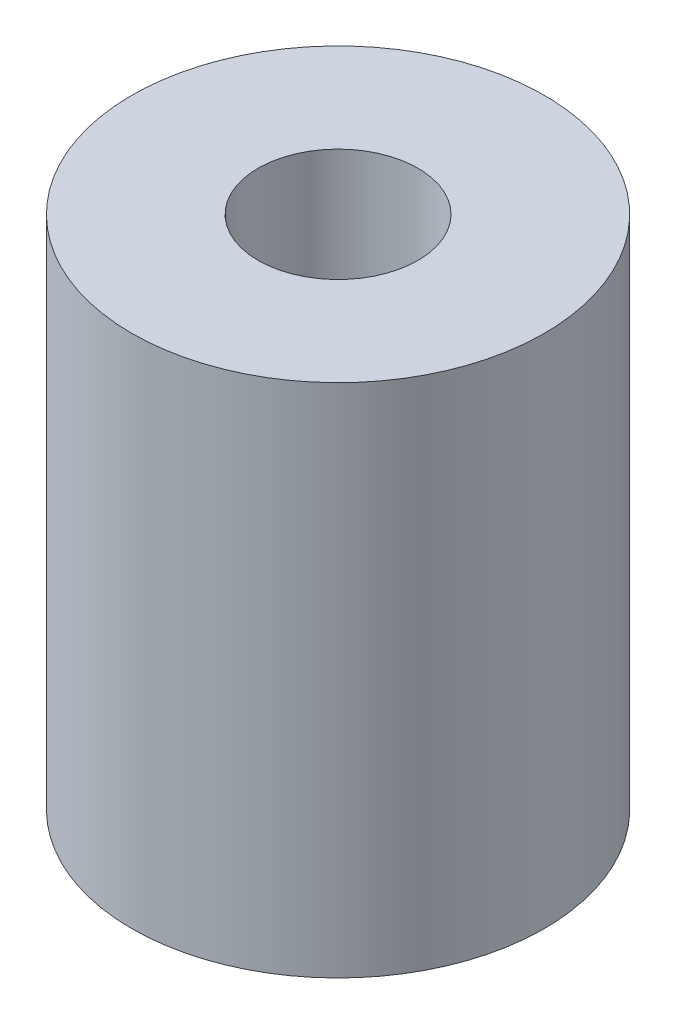
ISO-10303-21;
HEADER;
FILE_DESCRIPTION(('STEP AP214'),'2;1');
FILE_NAME('part.step','',(''),(''),'','','');
FILE_SCHEMA(('AUTOMOTIVE_DESIGN { 1 0 10303 214 1 1 1 1 }'));
ENDSEC;
DATA;
#1=APPLICATION_CONTEXT('core data for automotive mechanical design processes');
#2=APPLICATION_PROTOCOL_DEFINITION('international standard','automotive_design',2000,#1);
#3=PRODUCT_CONTEXT('',#1,'mechanical');
#4=PRODUCT('Part','Part','',(#3));
#5=PRODUCT_RELATED_PRODUCT_CATEGORY('part','',(#4));
#6=PRODUCT_DEFINITION_FORMATION('','',#4);
#7=PRODUCT_DEFINITION_CONTEXT('part definition',#1,'design');
#8=PRODUCT_DEFINITION('design','',#6,#7);
#9=PRODUCT_DEFINITION_SHAPE('','',#8);
#10=(LENGTH_UNIT() NAMED_UNIT(*) SI_UNIT(.MILLI.,.METRE.));
#11=(NAMED_UNIT(*) PLANE_ANGLE_UNIT() SI_UNIT($,.RADIAN.));
#12=(NAMED_UNIT(*) SI_UNIT($,.STERADIAN.) SOLID_ANGLE_UNIT());
#13=UNCERTAINTY_MEASURE_WITH_UNIT(LENGTH_MEASURE(1.E-05),#10,'distance_accuracy_value','');
#14=(GEOMETRIC_REPRESENTATION_CONTEXT(3) GLOBAL_UNCERTAINTY_ASSIGNED_CONTEXT((#13)) GLOBAL_UNIT_ASSIGNED_CONTEXT((#10,
#11,#12)) REPRESENTATION_CONTEXT('',''));
#15=CARTESIAN_POINT('',(0.,0.,0.));
#16=DIRECTION('',(0.,0.,1.));
#17=DIRECTION('',(1.,0.,0.));
#18=AXIS2_PLACEMENT_3D('',#15,#16,#17);
#19=CARTESIAN_POINT('',(0.,20.,0.));
#20=DIRECTION('',(0.,-1.,0.));
#21=DIRECTION('',(0.,0.,-1.));
#22=AXIS2_PLACEMENT_3D('',#19,#20,#21);
#23=CYLINDRICAL_SURFACE('',#22,8.);
#24=CARTESIAN_POINT('',(0.,20.,0.));
#25=DIRECTION('',(0.,1.,0.));
#26=DIRECTION('',(0.,0.,1.));
#27=AXIS2_PLACEMENT_3D('',#24,#25,#26);
#28=CIRCLE('',#27,8.);
#29=CARTESIAN_POINT('',(0.,20.,8.));
#30=VERTEX_POINT('',#29);
#31=EDGE_CURVE('E10',#30,#30,#28,.T.);
#32=ORIENTED_EDGE('',*,*,#31,.F.);
#33=EDGE_LOOP('',(#32));
#34=FACE_BOUND('',#33,.T.);
#35=CARTESIAN_POINT('',(0.,0.,0.));
#36=DIRECTION('',(0.,1.,0.));
#37=DIRECTION('',(0.,0.,1.));
#38=AXIS2_PLACEMENT_3D('',#35,#36,#37);
#39=CIRCLE('',#38,8.);
#40=CARTESIAN_POINT('',(0.,0.,8.));
#41=VERTEX_POINT('',#40);
#42=EDGE_CURVE('E40',#41,#41,#39,.T.);
#43=ORIENTED_EDGE('',*,*,#42,.T.);
#44=EDGE_LOOP('',(#43));
#45=FACE_BOUND('',#44,.T.);
#46=ADVANCED_FACE('F37',(#34,#45),#23,.T.);
#47=CARTESIAN_POINT('',(0.,20.,0.));
#48=DIRECTION('',(0.,1.,0.));
#49=DIRECTION('',(0.,0.,1.));
#50=AXIS2_PLACEMENT_3D('',#47,#48,#49);
#51=PLANE('',#50);
#52=CARTESIAN_POINT('',(0.,20.,0.));
#53=DIRECTION('',(0.,1.,0.));
#54=DIRECTION('',(0.,0.,1.));
#55=AXIS2_PLACEMENT_3D('',#52,#53,#54);
#56=CIRCLE('',#55,3.1);
#57=CARTESIAN_POINT('',(0.,20.,3.1));
#58=VERTEX_POINT('',#57);
#59=EDGE_CURVE('E51',#58,#58,#56,.T.);
#60=ORIENTED_EDGE('',*,*,#59,.F.);
#61=EDGE_LOOP('',(#60));
#62=FACE_BOUND('',#61,.T.);
#63=ORIENTED_EDGE('',*,*,#31,.T.);
#64=EDGE_LOOP('',(#63));
#65=FACE_BOUND('',#64,.T.);
#66=ADVANCED_FACE('F58',(#62,#65),#51,.T.);
#67=CARTESIAN_POINT('',(0.,0.,0.));
#68=DIRECTION('',(0.,1.,0.));
#69=DIRECTION('',(0.,0.,1.));
#70=AXIS2_PLACEMENT_3D('',#67,#68,#69);
#71=PLANE('',#70);
#72=CARTESIAN_POINT('',(0.,0.,0.));
#73=DIRECTION('',(0.,1.,0.));
#74=DIRECTION('',(0.,0.,1.));
#75=AXIS2_PLACEMENT_3D('',#72,#73,#74);
#76=CIRCLE('',#75,3.1);
#77=CARTESIAN_POINT('',(0.,0.,3.1));
#78=VERTEX_POINT('',#77);
#79=EDGE_CURVE('E47',#78,#78,#76,.F.);
#80=ORIENTED_EDGE('',*,*,#79,.F.);
#81=EDGE_LOOP('',(#80));
#82=FACE_BOUND('',#81,.T.);
#83=ORIENTED_EDGE('',*,*,#42,.F.);
#84=EDGE_LOOP('',(#83));
#85=FACE_BOUND('',#84,.T.);
#86=ADVANCED_FACE('F60',(#82,#85),#71,.F.);
#87=CARTESIAN_POINT('',(0.,-0.001000000000001,0.));
#88=DIRECTION('',(0.,1.,0.));
#89=DIRECTION('',(0.,0.,1.));
#90=AXIS2_PLACEMENT_3D('',#87,#88,#89);
#91=CYLINDRICAL_SURFACE('',#90,3.1);
#92=ORIENTED_EDGE('',*,*,#59,.T.);
#93=EDGE_LOOP('',(#92));
#94=FACE_BOUND('',#93,.T.);
#95=ORIENTED_EDGE('',*,*,#79,.T.);
#96=EDGE_LOOP('',(#95));
#97=FACE_BOUND('',#96,.T.);
#98=ADVANCED_FACE('F55',(#94,#97),#91,.F.);
#99=CLOSED_SHELL('',(#46,#66,#86,#98));
#100=MANIFOLD_SOLID_BREP('B2',#99);
#101=ADVANCED_BREP_SHAPE_REPRESENTATION('',(#18,#100),#14);
#102=SHAPE_DEFINITION_REPRESENTATION(#9,#101);
ENDSEC;
END-ISO-10303-21;
